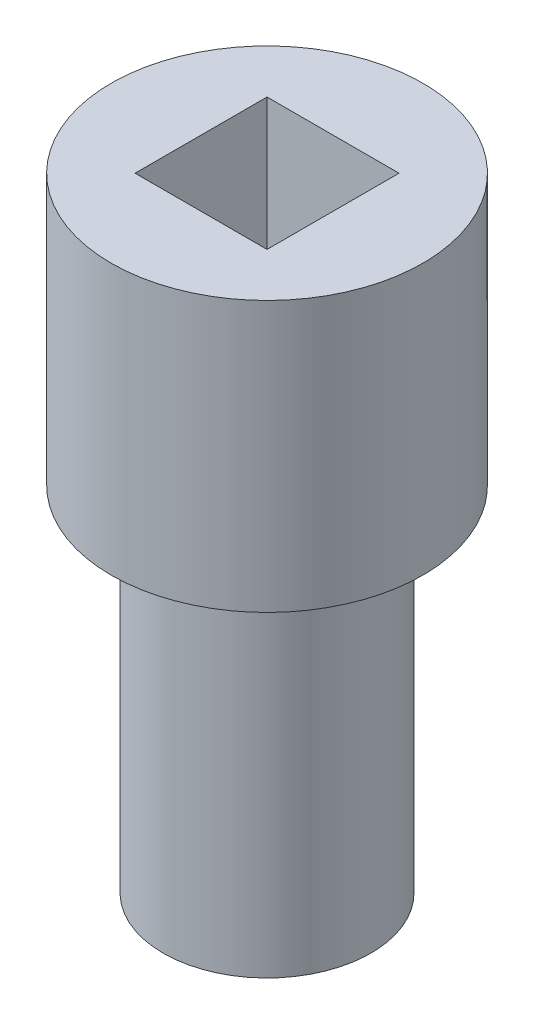
ISO-10303-21;
HEADER;
FILE_DESCRIPTION(('STEP AP214'),'2;1');
FILE_NAME('part.step','',(''),(''),'','','');
FILE_SCHEMA(('AUTOMOTIVE_DESIGN { 1 0 10303 214 1 1 1 1 }'));
ENDSEC;
DATA;
#1=APPLICATION_CONTEXT('core data for automotive mechanical design processes');
#2=APPLICATION_PROTOCOL_DEFINITION('international standard','automotive_design',2000,#1);
#3=PRODUCT_CONTEXT('',#1,'mechanical');
#4=PRODUCT('Part','Part','',(#3));
#5=PRODUCT_RELATED_PRODUCT_CATEGORY('part','',(#4));
#6=PRODUCT_DEFINITION_FORMATION('','',#4);
#7=PRODUCT_DEFINITION_CONTEXT('part definition',#1,'design');
#8=PRODUCT_DEFINITION('design','',#6,#7);
#9=PRODUCT_DEFINITION_SHAPE('','',#8);
#10=(LENGTH_UNIT() NAMED_UNIT(*) SI_UNIT(.MILLI.,.METRE.));
#11=(NAMED_UNIT(*) PLANE_ANGLE_UNIT() SI_UNIT($,.RADIAN.));
#12=(NAMED_UNIT(*) SI_UNIT($,.STERADIAN.) SOLID_ANGLE_UNIT());
#13=UNCERTAINTY_MEASURE_WITH_UNIT(LENGTH_MEASURE(1.E-05),#10,'distance_accuracy_value','');
#14=(GEOMETRIC_REPRESENTATION_CONTEXT(3) GLOBAL_UNCERTAINTY_ASSIGNED_CONTEXT((#13)) GLOBAL_UNIT_ASSIGNED_CONTEXT((#10,
#11,#12)) REPRESENTATION_CONTEXT('',''));
#15=CARTESIAN_POINT('',(0.,0.,0.));
#16=DIRECTION('',(0.,0.,1.));
#17=DIRECTION('',(1.,0.,0.));
#18=AXIS2_PLACEMENT_3D('',#15,#16,#17);
#19=CARTESIAN_POINT('',(3.175,10.,0.));
#20=DIRECTION('',(-1.,0.,0.));
#21=DIRECTION('',(0.,0.,1.));
#22=AXIS2_PLACEMENT_3D('',#19,#20,#21);
#23=PLANE('',#22);
#24=DIRECTION('',(0.,0.,-1.));
#25=VECTOR('',#24,1.);
#26=CARTESIAN_POINT('',(3.175,0.,0.));
#27=LINE('',#26,#25);
#28=CARTESIAN_POINT('',(3.175,0.,3.175));
#29=VERTEX_POINT('',#28);
#30=CARTESIAN_POINT('',(3.175,0.,-3.175));
#31=VERTEX_POINT('',#30);
#32=EDGE_CURVE('E83',#29,#31,#27,.T.);
#33=ORIENTED_EDGE('',*,*,#32,.F.);
#34=DIRECTION('',(0.,-1.,0.));
#35=VECTOR('',#34,1.);
#36=CARTESIAN_POINT('',(3.175,10.,3.175));
#37=LINE('',#36,#35);
#38=CARTESIAN_POINT('',(3.175,10.,3.175));
#39=VERTEX_POINT('',#38);
#40=EDGE_CURVE('E11',#39,#29,#37,.T.);
#41=ORIENTED_EDGE('',*,*,#40,.F.);
#42=DIRECTION('',(0.,0.,-1.));
#43=VECTOR('',#42,1.);
#44=CARTESIAN_POINT('',(3.175,10.,0.));
#45=LINE('',#44,#43);
#46=CARTESIAN_POINT('',(3.175,10.,-3.175));
#47=VERTEX_POINT('',#46);
#48=EDGE_CURVE('E87',#39,#47,#45,.T.);
#49=ORIENTED_EDGE('',*,*,#48,.T.);
#50=DIRECTION('',(0.,-1.,0.));
#51=VECTOR('',#50,1.);
#52=CARTESIAN_POINT('',(3.175,10.,-3.175));
#53=LINE('',#52,#51);
#54=EDGE_CURVE('E98',#47,#31,#53,.T.);
#55=ORIENTED_EDGE('',*,*,#54,.T.);
#56=EDGE_LOOP('',(#33,#41,#49,#55));
#57=FACE_BOUND('',#56,.T.);
#58=ADVANCED_FACE('F41',(#57),#23,.T.);
#59=CARTESIAN_POINT('',(0.,10.,3.175));
#60=DIRECTION('',(0.,0.,-1.));
#61=DIRECTION('',(-1.,0.,0.));
#62=AXIS2_PLACEMENT_3D('',#59,#60,#61);
#63=PLANE('',#62);
#64=DIRECTION('',(1.,0.,0.));
#65=VECTOR('',#64,1.);
#66=CARTESIAN_POINT('',(0.,0.,3.175));
#67=LINE('',#66,#65);
#68=CARTESIAN_POINT('',(-3.175,0.,3.175));
#69=VERTEX_POINT('',#68);
#70=EDGE_CURVE('E95',#69,#29,#67,.T.);
#71=ORIENTED_EDGE('',*,*,#70,.F.);
#72=DIRECTION('',(0.,-1.,0.));
#73=VECTOR('',#72,1.);
#74=CARTESIAN_POINT('',(-3.175,10.,3.175));
#75=LINE('',#74,#73);
#76=CARTESIAN_POINT('',(-3.175,10.,3.175));
#77=VERTEX_POINT('',#76);
#78=EDGE_CURVE('E49',#77,#69,#75,.T.);
#79=ORIENTED_EDGE('',*,*,#78,.F.);
#80=DIRECTION('',(1.,0.,0.));
#81=VECTOR('',#80,1.);
#82=CARTESIAN_POINT('',(0.,10.,3.175));
#83=LINE('',#82,#81);
#84=EDGE_CURVE('E111',#77,#39,#83,.T.);
#85=ORIENTED_EDGE('',*,*,#84,.T.);
#86=ORIENTED_EDGE('',*,*,#40,.T.);
#87=EDGE_LOOP('',(#71,#79,#85,#86));
#88=FACE_BOUND('',#87,.T.);
#89=ADVANCED_FACE('F171',(#88),#63,.T.);
#90=CARTESIAN_POINT('',(-3.175,10.,0.));
#91=DIRECTION('',(-1.,0.,0.));
#92=DIRECTION('',(0.,0.,1.));
#93=AXIS2_PLACEMENT_3D('',#90,#91,#92);
#94=PLANE('',#93);
#95=DIRECTION('',(0.,0.,-1.));
#96=VECTOR('',#95,1.);
#97=CARTESIAN_POINT('',(-3.175,0.,0.));
#98=LINE('',#97,#96);
#99=CARTESIAN_POINT('',(-3.175,0.,-3.175));
#100=VERTEX_POINT('',#99);
#101=EDGE_CURVE('E80',#69,#100,#98,.T.);
#102=ORIENTED_EDGE('',*,*,#101,.T.);
#103=DIRECTION('',(0.,-1.,0.));
#104=VECTOR('',#103,1.);
#105=CARTESIAN_POINT('',(-3.175,10.,-3.175));
#106=LINE('',#105,#104);
#107=CARTESIAN_POINT('',(-3.175,10.,-3.175));
#108=VERTEX_POINT('',#107);
#109=EDGE_CURVE('E93',#108,#100,#106,.T.);
#110=ORIENTED_EDGE('',*,*,#109,.F.);
#111=DIRECTION('',(0.,0.,-1.));
#112=VECTOR('',#111,1.);
#113=CARTESIAN_POINT('',(-3.175,10.,0.));
#114=LINE('',#113,#112);
#115=EDGE_CURVE('E109',#77,#108,#114,.T.);
#116=ORIENTED_EDGE('',*,*,#115,.F.);
#117=ORIENTED_EDGE('',*,*,#78,.T.);
#118=EDGE_LOOP('',(#102,#110,#116,#117));
#119=FACE_BOUND('',#118,.T.);
#120=ADVANCED_FACE('F91',(#119),#94,.F.);
#121=CARTESIAN_POINT('',(0.,10.,-3.175));
#122=DIRECTION('',(0.,0.,-1.));
#123=DIRECTION('',(-1.,0.,0.));
#124=AXIS2_PLACEMENT_3D('',#121,#122,#123);
#125=PLANE('',#124);
#126=DIRECTION('',(1.,0.,0.));
#127=VECTOR('',#126,1.);
#128=CARTESIAN_POINT('',(0.,0.,-3.175));
#129=LINE('',#128,#127);
#130=EDGE_CURVE('E77',#100,#31,#129,.T.);
#131=ORIENTED_EDGE('',*,*,#130,.T.);
#132=ORIENTED_EDGE('',*,*,#54,.F.);
#133=DIRECTION('',(1.,0.,0.));
#134=VECTOR('',#133,1.);
#135=CARTESIAN_POINT('',(0.,10.,-3.175));
#136=LINE('',#135,#134);
#137=EDGE_CURVE('E56',#108,#47,#136,.T.);
#138=ORIENTED_EDGE('',*,*,#137,.F.);
#139=ORIENTED_EDGE('',*,*,#109,.T.);
#140=EDGE_LOOP('',(#131,#132,#138,#139));
#141=FACE_BOUND('',#140,.T.);
#142=ADVANCED_FACE('F97',(#141),#125,.F.);
#143=CARTESIAN_POINT('',(0.,10.,0.));
#144=DIRECTION('',(0.,-1.,0.));
#145=DIRECTION('',(0.,0.,-1.));
#146=AXIS2_PLACEMENT_3D('',#143,#144,#145);
#147=CYLINDRICAL_SURFACE('',#146,7.50000000000002);
#148=CARTESIAN_POINT('',(0.,10.,0.));
#149=DIRECTION('',(0.,1.,0.));
#150=DIRECTION('',(0.,0.,1.));
#151=AXIS2_PLACEMENT_3D('',#148,#149,#150);
#152=CIRCLE('',#151,7.50000000000002);
#153=CARTESIAN_POINT('',(0.,10.,7.50000000000002));
#154=VERTEX_POINT('',#153);
#155=EDGE_CURVE('E100',#154,#154,#152,.T.);
#156=ORIENTED_EDGE('',*,*,#155,.F.);
#157=EDGE_LOOP('',(#156));
#158=FACE_BOUND('',#157,.T.);
#159=CARTESIAN_POINT('',(0.,-3.,0.));
#160=DIRECTION('',(0.,1.,0.));
#161=DIRECTION('',(0.,0.,1.));
#162=AXIS2_PLACEMENT_3D('',#159,#160,#161);
#163=CIRCLE('',#162,7.50000000000002);
#164=CARTESIAN_POINT('',(0.,-3.,7.50000000000002));
#165=VERTEX_POINT('',#164);
#166=EDGE_CURVE('E118',#165,#165,#163,.T.);
#167=ORIENTED_EDGE('',*,*,#166,.T.);
#168=EDGE_LOOP('',(#167));
#169=FACE_BOUND('',#168,.T.);
#170=ADVANCED_FACE('F157',(#158,#169),#147,.T.);
#171=CARTESIAN_POINT('',(0.,10.,0.));
#172=DIRECTION('',(0.,1.,0.));
#173=DIRECTION('',(0.,0.,1.));
#174=AXIS2_PLACEMENT_3D('',#171,#172,#173);
#175=PLANE('',#174);
#176=ORIENTED_EDGE('',*,*,#48,.F.);
#177=ORIENTED_EDGE('',*,*,#84,.F.);
#178=ORIENTED_EDGE('',*,*,#115,.T.);
#179=ORIENTED_EDGE('',*,*,#137,.T.);
#180=EDGE_LOOP('',(#176,#177,#178,#179));
#181=FACE_BOUND('',#180,.T.);
#182=ORIENTED_EDGE('',*,*,#155,.T.);
#183=EDGE_LOOP('',(#182));
#184=FACE_BOUND('',#183,.T.);
#185=ADVANCED_FACE('F159',(#181,#184),#175,.T.);
#186=CARTESIAN_POINT('',(0.,0.,0.));
#187=DIRECTION('',(0.,1.,0.));
#188=DIRECTION('',(0.,0.,1.));
#189=AXIS2_PLACEMENT_3D('',#186,#187,#188);
#190=PLANE('',#189);
#191=ORIENTED_EDGE('',*,*,#70,.T.);
#192=ORIENTED_EDGE('',*,*,#32,.T.);
#193=ORIENTED_EDGE('',*,*,#130,.F.);
#194=ORIENTED_EDGE('',*,*,#101,.F.);
#195=EDGE_LOOP('',(#191,#192,#193,#194));
#196=FACE_BOUND('',#195,.T.);
#197=ADVANCED_FACE('F79',(#196),#190,.T.);
#198=CARTESIAN_POINT('',(0.,-3.,0.));
#199=DIRECTION('',(0.,1.,0.));
#200=DIRECTION('',(0.,0.,1.));
#201=AXIS2_PLACEMENT_3D('',#198,#199,#200);
#202=PLANE('',#201);
#203=CARTESIAN_POINT('',(0.,-3.,0.));
#204=DIRECTION('',(0.,1.,0.));
#205=DIRECTION('',(0.,0.,1.));
#206=AXIS2_PLACEMENT_3D('',#203,#204,#205);
#207=CIRCLE('',#206,5.);
#208=CARTESIAN_POINT('',(0.,-3.,5.));
#209=VERTEX_POINT('',#208);
#210=EDGE_CURVE('E121',#209,#209,#207,.T.);
#211=ORIENTED_EDGE('',*,*,#210,.T.);
#212=EDGE_LOOP('',(#211));
#213=FACE_BOUND('',#212,.T.);
#214=ORIENTED_EDGE('',*,*,#166,.F.);
#215=EDGE_LOOP('',(#214));
#216=FACE_BOUND('',#215,.T.);
#217=ADVANCED_FACE('F143',(#213,#216),#202,.F.);
#218=CARTESIAN_POINT('',(0.,-20.,0.));
#219=DIRECTION('',(0.,1.,0.));
#220=DIRECTION('',(0.,0.,1.));
#221=AXIS2_PLACEMENT_3D('',#218,#219,#220);
#222=PLANE('',#221);
#223=CARTESIAN_POINT('',(0.,-20.,0.));
#224=DIRECTION('',(0.,-1.,0.));
#225=DIRECTION('',(0.,0.,-1.));
#226=AXIS2_PLACEMENT_3D('',#223,#224,#225);
#227=CIRCLE('',#226,2.);
#228=CARTESIAN_POINT('',(0.,-20.,-2.));
#229=VERTEX_POINT('',#228);
#230=EDGE_CURVE('E125',#229,#229,#227,.T.);
#231=ORIENTED_EDGE('',*,*,#230,.F.);
#232=EDGE_LOOP('',(#231));
#233=FACE_BOUND('',#232,.T.);
#234=CARTESIAN_POINT('',(0.,-20.,0.));
#235=DIRECTION('',(0.,1.,0.));
#236=DIRECTION('',(0.,0.,1.));
#237=AXIS2_PLACEMENT_3D('',#234,#235,#236);
#238=CIRCLE('',#237,5.);
#239=CARTESIAN_POINT('',(0.,-20.,5.));
#240=VERTEX_POINT('',#239);
#241=EDGE_CURVE('E105',#240,#240,#238,.T.);
#242=ORIENTED_EDGE('',*,*,#241,.F.);
#243=EDGE_LOOP('',(#242));
#244=FACE_BOUND('',#243,.T.);
#245=ADVANCED_FACE('F140',(#233,#244),#222,.F.);
#246=CARTESIAN_POINT('',(0.,-20.,0.));
#247=DIRECTION('',(0.,1.,0.));
#248=DIRECTION('',(0.,0.,1.));
#249=AXIS2_PLACEMENT_3D('',#246,#247,#248);
#250=CYLINDRICAL_SURFACE('',#249,5.);
#251=ORIENTED_EDGE('',*,*,#241,.T.);
#252=EDGE_LOOP('',(#251));
#253=FACE_BOUND('',#252,.T.);
#254=ORIENTED_EDGE('',*,*,#210,.F.);
#255=EDGE_LOOP('',(#254));
#256=FACE_BOUND('',#255,.T.);
#257=ADVANCED_FACE('F136',(#253,#256),#250,.T.);
#258=CARTESIAN_POINT('',(0.,-11.5,0.));
#259=DIRECTION('',(0.,-1.,0.));
#260=DIRECTION('',(0.,0.,-1.));
#261=AXIS2_PLACEMENT_3D('',#258,#259,#260);
#262=CYLINDRICAL_SURFACE('',#261,2.);
#263=CARTESIAN_POINT('',(0.,-11.5,0.));
#264=DIRECTION('',(0.,-1.,0.));
#265=DIRECTION('',(0.,0.,-1.));
#266=AXIS2_PLACEMENT_3D('',#263,#264,#265);
#267=CIRCLE('',#266,2.);
#268=CARTESIAN_POINT('',(0.,-11.5,-2.));
#269=VERTEX_POINT('',#268);
#270=EDGE_CURVE('E124',#269,#269,#267,.T.);
#271=ORIENTED_EDGE('',*,*,#270,.F.);
#272=EDGE_LOOP('',(#271));
#273=FACE_BOUND('',#272,.T.);
#274=ORIENTED_EDGE('',*,*,#230,.T.);
#275=EDGE_LOOP('',(#274));
#276=FACE_BOUND('',#275,.T.);
#277=ADVANCED_FACE('F133',(#273,#276),#262,.F.);
#278=CARTESIAN_POINT('',(0.,-11.5,0.));
#279=DIRECTION('',(0.,-1.,0.));
#280=DIRECTION('',(0.,0.,-1.));
#281=AXIS2_PLACEMENT_3D('',#278,#279,#280);
#282=PLANE('',#281);
#283=ORIENTED_EDGE('',*,*,#270,.T.);
#284=EDGE_LOOP('',(#283));
#285=FACE_BOUND('',#284,.T.);
#286=ADVANCED_FACE('F131',(#285),#282,.T.);
#287=CLOSED_SHELL('',(#58,#89,#120,#142,#170,#185,#197,#217,#245,#257,#277,#286));
#288=MANIFOLD_SOLID_BREP('B2',#287);
#289=ADVANCED_BREP_SHAPE_REPRESENTATION('',(#18,#288),#14);
#290=SHAPE_DEFINITION_REPRESENTATION(#9,#289);
ENDSEC;
END-ISO-10303-21;
